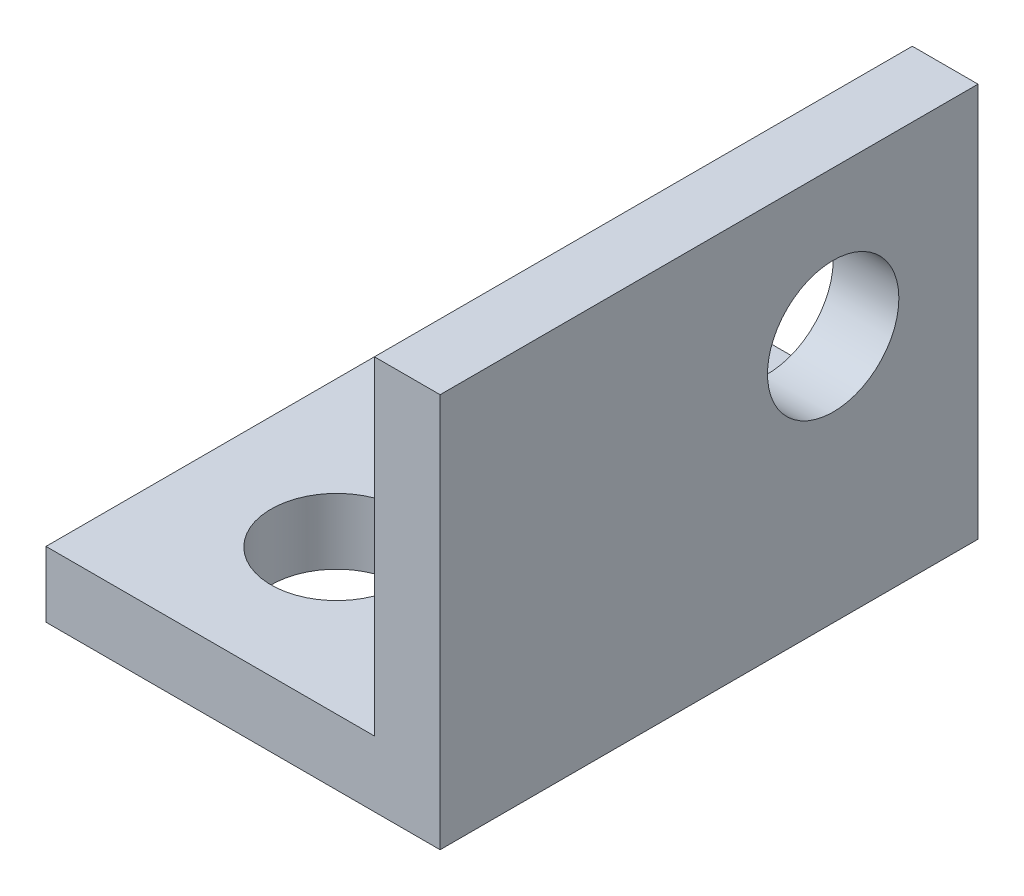
ISO-10303-21;
HEADER;
FILE_DESCRIPTION(('STEP AP214'),'2;1');
FILE_NAME('part.step','',(''),(''),'','','');
FILE_SCHEMA(('AUTOMOTIVE_DESIGN { 1 0 10303 214 1 1 1 1 }'));
ENDSEC;
DATA;
#1=APPLICATION_CONTEXT('core data for automotive mechanical design processes');
#2=APPLICATION_PROTOCOL_DEFINITION('international standard','automotive_design',2000,#1);
#3=PRODUCT_CONTEXT('',#1,'mechanical');
#4=PRODUCT('Part','Part','',(#3));
#5=PRODUCT_RELATED_PRODUCT_CATEGORY('part','',(#4));
#6=PRODUCT_DEFINITION_FORMATION('','',#4);
#7=PRODUCT_DEFINITION_CONTEXT('part definition',#1,'design');
#8=PRODUCT_DEFINITION('design','',#6,#7);
#9=PRODUCT_DEFINITION_SHAPE('','',#8);
#10=(LENGTH_UNIT() NAMED_UNIT(*) SI_UNIT(.MILLI.,.METRE.));
#11=(NAMED_UNIT(*) PLANE_ANGLE_UNIT() SI_UNIT($,.RADIAN.));
#12=(NAMED_UNIT(*) SI_UNIT($,.STERADIAN.) SOLID_ANGLE_UNIT());
#13=UNCERTAINTY_MEASURE_WITH_UNIT(LENGTH_MEASURE(1.E-05),#10,'distance_accuracy_value','');
#14=(GEOMETRIC_REPRESENTATION_CONTEXT(3) GLOBAL_UNCERTAINTY_ASSIGNED_CONTEXT((#13)) GLOBAL_UNIT_ASSIGNED_CONTEXT((#10,
#11,#12)) REPRESENTATION_CONTEXT('',''));
#15=CARTESIAN_POINT('',(0.,0.,0.));
#16=DIRECTION('',(0.,0.,1.));
#17=DIRECTION('',(1.,0.,0.));
#18=AXIS2_PLACEMENT_3D('',#15,#16,#17);
#19=CARTESIAN_POINT('',(3.175,4.7625,6.5));
#20=DIRECTION('',(1.,0.,0.));
#21=DIRECTION('',(0.,1.,0.));
#22=AXIS2_PLACEMENT_3D('',#19,#20,#21);
#23=PLANE('',#22);
#24=CARTESIAN_POINT('',(3.175,1.2375,-3.));
#25=DIRECTION('',(1.,0.,0.));
#26=DIRECTION('',(0.,1.,0.));
#27=AXIS2_PLACEMENT_3D('',#24,#25,#26);
#28=CIRCLE('',#27,1.5875);
#29=CARTESIAN_POINT('',(3.175,2.825,-3.));
#30=VERTEX_POINT('',#29);
#31=EDGE_CURVE('E133',#30,#30,#28,.T.);
#32=ORIENTED_EDGE('',*,*,#31,.T.);
#33=EDGE_LOOP('',(#32));
#34=FACE_BOUND('',#33,.T.);
#35=DIRECTION('',(0.,-1.,0.));
#36=VECTOR('',#35,1.);
#37=CARTESIAN_POINT('',(3.175,4.7625,-6.5));
#38=LINE('',#37,#36);
#39=CARTESIAN_POINT('',(3.175,4.7625,-6.5));
#40=VERTEX_POINT('',#39);
#41=CARTESIAN_POINT('',(3.175,-3.175,-6.5));
#42=VERTEX_POINT('',#41);
#43=EDGE_CURVE('E128',#40,#42,#38,.T.);
#44=ORIENTED_EDGE('',*,*,#43,.T.);
#45=DIRECTION('',(0.,0.,-1.));
#46=VECTOR('',#45,1.);
#47=CARTESIAN_POINT('',(3.175,-3.175,6.5));
#48=LINE('',#47,#46);
#49=CARTESIAN_POINT('',(3.175,-3.175,6.5));
#50=VERTEX_POINT('',#49);
#51=EDGE_CURVE('E11',#50,#42,#48,.T.);
#52=ORIENTED_EDGE('',*,*,#51,.F.);
#53=DIRECTION('',(0.,-1.,0.));
#54=VECTOR('',#53,1.);
#55=CARTESIAN_POINT('',(3.175,4.7625,6.5));
#56=LINE('',#55,#54);
#57=CARTESIAN_POINT('',(3.175,4.7625,6.5));
#58=VERTEX_POINT('',#57);
#59=EDGE_CURVE('E145',#58,#50,#56,.T.);
#60=ORIENTED_EDGE('',*,*,#59,.F.);
#61=DIRECTION('',(0.,0.,-1.));
#62=VECTOR('',#61,1.);
#63=CARTESIAN_POINT('',(3.175,4.7625,6.5));
#64=LINE('',#63,#62);
#65=EDGE_CURVE('E124',#58,#40,#64,.T.);
#66=ORIENTED_EDGE('',*,*,#65,.T.);
#67=EDGE_LOOP('',(#44,#52,#60,#66));
#68=FACE_BOUND('',#67,.T.);
#69=ADVANCED_FACE('F39',(#34,#68),#23,.F.);
#70=CARTESIAN_POINT('',(3.175,-3.175,6.5));
#71=DIRECTION('',(0.,-1.,0.));
#72=DIRECTION('',(1.,0.,0.));
#73=AXIS2_PLACEMENT_3D('',#70,#71,#72);
#74=PLANE('',#73);
#75=CARTESIAN_POINT('',(-1.2375,-3.175,3.));
#76=DIRECTION('',(0.,-1.,0.));
#77=DIRECTION('',(1.,0.,0.));
#78=AXIS2_PLACEMENT_3D('',#75,#76,#77);
#79=CIRCLE('',#78,1.5875);
#80=CARTESIAN_POINT('',(0.35,-3.175,3.));
#81=VERTEX_POINT('',#80);
#82=EDGE_CURVE('E188',#81,#81,#79,.T.);
#83=ORIENTED_EDGE('',*,*,#82,.T.);
#84=EDGE_LOOP('',(#83));
#85=FACE_BOUND('',#84,.T.);
#86=DIRECTION('',(-1.,0.,0.));
#87=VECTOR('',#86,1.);
#88=CARTESIAN_POINT('',(3.175,-3.175,-6.5));
#89=LINE('',#88,#87);
#90=CARTESIAN_POINT('',(-4.7625,-3.175,-6.5));
#91=VERTEX_POINT('',#90);
#92=EDGE_CURVE('E132',#42,#91,#89,.T.);
#93=ORIENTED_EDGE('',*,*,#92,.T.);
#94=DIRECTION('',(0.,0.,-1.));
#95=VECTOR('',#94,1.);
#96=CARTESIAN_POINT('',(-4.7625,-3.175,6.5));
#97=LINE('',#96,#95);
#98=CARTESIAN_POINT('',(-4.7625,-3.175,6.5));
#99=VERTEX_POINT('',#98);
#100=EDGE_CURVE('E48',#99,#91,#97,.T.);
#101=ORIENTED_EDGE('',*,*,#100,.F.);
#102=DIRECTION('',(-1.,0.,0.));
#103=VECTOR('',#102,1.);
#104=CARTESIAN_POINT('',(3.175,-3.175,6.5));
#105=LINE('',#104,#103);
#106=EDGE_CURVE('E93',#50,#99,#105,.T.);
#107=ORIENTED_EDGE('',*,*,#106,.F.);
#108=ORIENTED_EDGE('',*,*,#51,.T.);
#109=EDGE_LOOP('',(#93,#101,#107,#108));
#110=FACE_BOUND('',#109,.T.);
#111=ADVANCED_FACE('F174',(#85,#110),#74,.F.);
#112=CARTESIAN_POINT('',(-4.7625,-4.7625,6.5));
#113=DIRECTION('',(1.,0.,0.));
#114=DIRECTION('',(0.,0.,-1.));
#115=AXIS2_PLACEMENT_3D('',#112,#113,#114);
#116=PLANE('',#115);
#117=DIRECTION('',(0.,-1.,0.));
#118=VECTOR('',#117,1.);
#119=CARTESIAN_POINT('',(-4.7625,-4.7625,-6.5));
#120=LINE('',#119,#118);
#121=CARTESIAN_POINT('',(-4.7625,-4.7625,-6.5));
#122=VERTEX_POINT('',#121);
#123=EDGE_CURVE('E136',#91,#122,#120,.T.);
#124=ORIENTED_EDGE('',*,*,#123,.T.);
#125=DIRECTION('',(0.,0.,-1.));
#126=VECTOR('',#125,1.);
#127=CARTESIAN_POINT('',(-4.7625,-4.7625,6.5));
#128=LINE('',#127,#126);
#129=CARTESIAN_POINT('',(-4.7625,-4.7625,6.5));
#130=VERTEX_POINT('',#129);
#131=EDGE_CURVE('E117',#130,#122,#128,.T.);
#132=ORIENTED_EDGE('',*,*,#131,.F.);
#133=DIRECTION('',(0.,-1.,0.));
#134=VECTOR('',#133,1.);
#135=CARTESIAN_POINT('',(-4.7625,-4.7625,6.5));
#136=LINE('',#135,#134);
#137=EDGE_CURVE('E106',#99,#130,#136,.T.);
#138=ORIENTED_EDGE('',*,*,#137,.F.);
#139=ORIENTED_EDGE('',*,*,#100,.T.);
#140=EDGE_LOOP('',(#124,#132,#138,#139));
#141=FACE_BOUND('',#140,.T.);
#142=ADVANCED_FACE('F155',(#141),#116,.F.);
#143=CARTESIAN_POINT('',(-4.7625,-4.7625,6.5));
#144=DIRECTION('',(0.,1.,0.));
#145=DIRECTION('',(0.,0.,1.));
#146=AXIS2_PLACEMENT_3D('',#143,#144,#145);
#147=PLANE('',#146);
#148=CARTESIAN_POINT('',(-1.2375,-4.7625,3.));
#149=DIRECTION('',(0.,-1.,0.));
#150=DIRECTION('',(0.,0.,-1.));
#151=AXIS2_PLACEMENT_3D('',#148,#149,#150);
#152=CIRCLE('',#151,1.5875);
#153=CARTESIAN_POINT('',(-1.2375,-4.7625,1.4125));
#154=VERTEX_POINT('',#153);
#155=EDGE_CURVE('E199',#154,#154,#152,.T.);
#156=ORIENTED_EDGE('',*,*,#155,.F.);
#157=EDGE_LOOP('',(#156));
#158=FACE_BOUND('',#157,.T.);
#159=DIRECTION('',(1.,0.,0.));
#160=VECTOR('',#159,1.);
#161=CARTESIAN_POINT('',(-4.7625,-4.7625,-6.5));
#162=LINE('',#161,#160);
#163=CARTESIAN_POINT('',(4.7625,-4.7625,-6.5));
#164=VERTEX_POINT('',#163);
#165=EDGE_CURVE('E115',#122,#164,#162,.T.);
#166=ORIENTED_EDGE('',*,*,#165,.T.);
#167=DIRECTION('',(0.,0.,-1.));
#168=VECTOR('',#167,1.);
#169=CARTESIAN_POINT('',(4.7625,-4.7625,6.5));
#170=LINE('',#169,#168);
#171=CARTESIAN_POINT('',(4.7625,-4.7625,6.5));
#172=VERTEX_POINT('',#171);
#173=EDGE_CURVE('E112',#172,#164,#170,.T.);
#174=ORIENTED_EDGE('',*,*,#173,.F.);
#175=DIRECTION('',(1.,0.,0.));
#176=VECTOR('',#175,1.);
#177=CARTESIAN_POINT('',(-4.7625,-4.7625,6.5));
#178=LINE('',#177,#176);
#179=EDGE_CURVE('E100',#130,#172,#178,.T.);
#180=ORIENTED_EDGE('',*,*,#179,.F.);
#181=ORIENTED_EDGE('',*,*,#131,.T.);
#182=EDGE_LOOP('',(#166,#174,#180,#181));
#183=FACE_BOUND('',#182,.T.);
#184=ADVANCED_FACE('F113',(#158,#183),#147,.F.);
#185=CARTESIAN_POINT('',(4.7625,-4.7625,6.5));
#186=DIRECTION('',(-1.,0.,0.));
#187=DIRECTION('',(0.,0.,1.));
#188=AXIS2_PLACEMENT_3D('',#185,#186,#187);
#189=PLANE('',#188);
#190=CARTESIAN_POINT('',(4.7625,1.2375,-3.));
#191=DIRECTION('',(1.,0.,0.));
#192=DIRECTION('',(0.,0.,-1.));
#193=AXIS2_PLACEMENT_3D('',#190,#191,#192);
#194=CIRCLE('',#193,1.5875);
#195=CARTESIAN_POINT('',(4.7625,1.2375,-4.5875));
#196=VERTEX_POINT('',#195);
#197=EDGE_CURVE('E184',#196,#196,#194,.T.);
#198=ORIENTED_EDGE('',*,*,#197,.F.);
#199=EDGE_LOOP('',(#198));
#200=FACE_BOUND('',#199,.T.);
#201=DIRECTION('',(0.,1.,0.));
#202=VECTOR('',#201,1.);
#203=CARTESIAN_POINT('',(4.7625,-4.7625,-6.5));
#204=LINE('',#203,#202);
#205=CARTESIAN_POINT('',(4.7625,4.7625,-6.5));
#206=VERTEX_POINT('',#205);
#207=EDGE_CURVE('E79',#164,#206,#204,.T.);
#208=ORIENTED_EDGE('',*,*,#207,.T.);
#209=DIRECTION('',(0.,0.,-1.));
#210=VECTOR('',#209,1.);
#211=CARTESIAN_POINT('',(4.7625,4.7625,6.5));
#212=LINE('',#211,#210);
#213=CARTESIAN_POINT('',(4.7625,4.7625,6.5));
#214=VERTEX_POINT('',#213);
#215=EDGE_CURVE('E118',#214,#206,#212,.T.);
#216=ORIENTED_EDGE('',*,*,#215,.F.);
#217=DIRECTION('',(0.,1.,0.));
#218=VECTOR('',#217,1.);
#219=CARTESIAN_POINT('',(4.7625,-4.7625,6.5));
#220=LINE('',#219,#218);
#221=EDGE_CURVE('E104',#172,#214,#220,.T.);
#222=ORIENTED_EDGE('',*,*,#221,.F.);
#223=ORIENTED_EDGE('',*,*,#173,.T.);
#224=EDGE_LOOP('',(#208,#216,#222,#223));
#225=FACE_BOUND('',#224,.T.);
#226=ADVANCED_FACE('F120',(#200,#225),#189,.F.);
#227=CARTESIAN_POINT('',(4.7625,4.7625,6.5));
#228=DIRECTION('',(0.,-1.,0.));
#229=DIRECTION('',(1.,0.,0.));
#230=AXIS2_PLACEMENT_3D('',#227,#228,#229);
#231=PLANE('',#230);
#232=DIRECTION('',(-1.,0.,0.));
#233=VECTOR('',#232,1.);
#234=CARTESIAN_POINT('',(4.7625,4.7625,-6.5));
#235=LINE('',#234,#233);
#236=EDGE_CURVE('E85',#206,#40,#235,.T.);
#237=ORIENTED_EDGE('',*,*,#236,.T.);
#238=ORIENTED_EDGE('',*,*,#65,.F.);
#239=DIRECTION('',(-1.,0.,0.));
#240=VECTOR('',#239,1.);
#241=CARTESIAN_POINT('',(4.7625,4.7625,6.5));
#242=LINE('',#241,#240);
#243=EDGE_CURVE('E56',#214,#58,#242,.T.);
#244=ORIENTED_EDGE('',*,*,#243,.F.);
#245=ORIENTED_EDGE('',*,*,#215,.T.);
#246=EDGE_LOOP('',(#237,#238,#244,#245));
#247=FACE_BOUND('',#246,.T.);
#248=ADVANCED_FACE('F162',(#247),#231,.F.);
#249=CARTESIAN_POINT('',(0.,0.,6.5));
#250=DIRECTION('',(0.,0.,-1.));
#251=DIRECTION('',(-1.,0.,0.));
#252=AXIS2_PLACEMENT_3D('',#249,#250,#251);
#253=PLANE('',#252);
#254=ORIENTED_EDGE('',*,*,#59,.T.);
#255=ORIENTED_EDGE('',*,*,#106,.T.);
#256=ORIENTED_EDGE('',*,*,#137,.T.);
#257=ORIENTED_EDGE('',*,*,#179,.T.);
#258=ORIENTED_EDGE('',*,*,#221,.T.);
#259=ORIENTED_EDGE('',*,*,#243,.T.);
#260=EDGE_LOOP('',(#254,#255,#256,#257,#258,#259));
#261=FACE_BOUND('',#260,.T.);
#262=ADVANCED_FACE('F102',(#261),#253,.F.);
#263=CARTESIAN_POINT('',(0.,0.,-6.5));
#264=DIRECTION('',(0.,0.,-1.));
#265=DIRECTION('',(-1.,0.,0.));
#266=AXIS2_PLACEMENT_3D('',#263,#264,#265);
#267=PLANE('',#266);
#268=ORIENTED_EDGE('',*,*,#43,.F.);
#269=ORIENTED_EDGE('',*,*,#236,.F.);
#270=ORIENTED_EDGE('',*,*,#207,.F.);
#271=ORIENTED_EDGE('',*,*,#165,.F.);
#272=ORIENTED_EDGE('',*,*,#123,.F.);
#273=ORIENTED_EDGE('',*,*,#92,.F.);
#274=EDGE_LOOP('',(#268,#269,#270,#271,#272,#273));
#275=FACE_BOUND('',#274,.T.);
#276=ADVANCED_FACE('F158',(#275),#267,.T.);
#277=CARTESIAN_POINT('',(-5.2375,1.2375,-3.));
#278=DIRECTION('',(1.,0.,0.));
#279=DIRECTION('',(0.,0.,-1.));
#280=AXIS2_PLACEMENT_3D('',#277,#278,#279);
#281=CYLINDRICAL_SURFACE('',#280,1.5875);
#282=ORIENTED_EDGE('',*,*,#197,.T.);
#283=EDGE_LOOP('',(#282));
#284=FACE_BOUND('',#283,.T.);
#285=ORIENTED_EDGE('',*,*,#31,.F.);
#286=EDGE_LOOP('',(#285));
#287=FACE_BOUND('',#286,.T.);
#288=ADVANCED_FACE('F225',(#284,#287),#281,.F.);
#289=CARTESIAN_POINT('',(-1.2375,5.2375,3.));
#290=DIRECTION('',(0.,-1.,0.));
#291=DIRECTION('',(0.,0.,-1.));
#292=AXIS2_PLACEMENT_3D('',#289,#290,#291);
#293=CYLINDRICAL_SURFACE('',#292,1.5875);
#294=ORIENTED_EDGE('',*,*,#155,.T.);
#295=EDGE_LOOP('',(#294));
#296=FACE_BOUND('',#295,.T.);
#297=ORIENTED_EDGE('',*,*,#82,.F.);
#298=EDGE_LOOP('',(#297));
#299=FACE_BOUND('',#298,.T.);
#300=ADVANCED_FACE('F204',(#296,#299),#293,.F.);
#301=CLOSED_SHELL('',(#69,#111,#142,#184,#226,#248,#262,#276,#288,#300));
#302=MANIFOLD_SOLID_BREP('B2',#301);
#303=ADVANCED_BREP_SHAPE_REPRESENTATION('',(#18,#302),#14);
#304=SHAPE_DEFINITION_REPRESENTATION(#9,#303);
ENDSEC;
END-ISO-10303-21;
